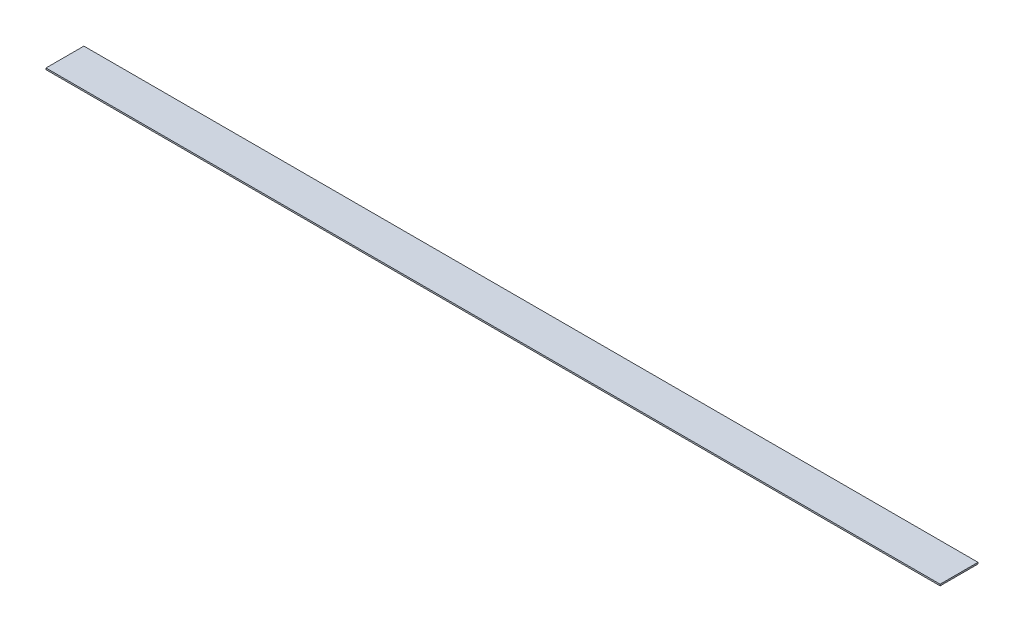
ISO-10303-21;
HEADER;
FILE_DESCRIPTION(('STEP AP214'),'2;1');
FILE_NAME('part.step','',(''),(''),'','','');
FILE_SCHEMA(('AUTOMOTIVE_DESIGN { 1 0 10303 214 1 1 1 1 }'));
ENDSEC;
DATA;
#1=APPLICATION_CONTEXT('core data for automotive mechanical design processes');
#2=APPLICATION_PROTOCOL_DEFINITION('international standard','automotive_design',2000,#1);
#3=PRODUCT_CONTEXT('',#1,'mechanical');
#4=PRODUCT('Part','Part','',(#3));
#5=PRODUCT_RELATED_PRODUCT_CATEGORY('part','',(#4));
#6=PRODUCT_DEFINITION_FORMATION('','',#4);
#7=PRODUCT_DEFINITION_CONTEXT('part definition',#1,'design');
#8=PRODUCT_DEFINITION('design','',#6,#7);
#9=PRODUCT_DEFINITION_SHAPE('','',#8);
#10=(LENGTH_UNIT() NAMED_UNIT(*) SI_UNIT(.MILLI.,.METRE.));
#11=(NAMED_UNIT(*) PLANE_ANGLE_UNIT() SI_UNIT($,.RADIAN.));
#12=(NAMED_UNIT(*) SI_UNIT($,.STERADIAN.) SOLID_ANGLE_UNIT());
#13=UNCERTAINTY_MEASURE_WITH_UNIT(LENGTH_MEASURE(1.E-05),#10,'distance_accuracy_value','');
#14=(GEOMETRIC_REPRESENTATION_CONTEXT(3) GLOBAL_UNCERTAINTY_ASSIGNED_CONTEXT((#13)) GLOBAL_UNIT_ASSIGNED_CONTEXT((#10,
#11,#12)) REPRESENTATION_CONTEXT('',''));
#15=CARTESIAN_POINT('',(0.,0.,0.));
#16=DIRECTION('',(0.,0.,1.));
#17=DIRECTION('',(1.,0.,0.));
#18=AXIS2_PLACEMENT_3D('',#15,#16,#17);
#19=CARTESIAN_POINT('',(295.,1.,-12.5));
#20=DIRECTION('',(-1.,0.,0.));
#21=DIRECTION('',(0.,0.,1.));
#22=AXIS2_PLACEMENT_3D('',#19,#20,#21);
#23=PLANE('',#22);
#24=DIRECTION('',(0.,0.,-1.));
#25=VECTOR('',#24,1.);
#26=CARTESIAN_POINT('',(295.,0.,-12.5));
#27=LINE('',#26,#25);
#28=CARTESIAN_POINT('',(295.,0.,12.5));
#29=VERTEX_POINT('',#28);
#30=CARTESIAN_POINT('',(295.,0.,-12.5));
#31=VERTEX_POINT('',#30);
#32=EDGE_CURVE('E98',#29,#31,#27,.T.);
#33=ORIENTED_EDGE('',*,*,#32,.T.);
#34=DIRECTION('',(0.,-1.,0.));
#35=VECTOR('',#34,1.);
#36=CARTESIAN_POINT('',(295.,1.,-12.5));
#37=LINE('',#36,#35);
#38=CARTESIAN_POINT('',(295.,1.,-12.5));
#39=VERTEX_POINT('',#38);
#40=EDGE_CURVE('E11',#39,#31,#37,.T.);
#41=ORIENTED_EDGE('',*,*,#40,.F.);
#42=DIRECTION('',(0.,0.,-1.));
#43=VECTOR('',#42,1.);
#44=CARTESIAN_POINT('',(295.,1.,-12.5));
#45=LINE('',#44,#43);
#46=CARTESIAN_POINT('',(295.,1.,12.5));
#47=VERTEX_POINT('',#46);
#48=EDGE_CURVE('E86',#47,#39,#45,.T.);
#49=ORIENTED_EDGE('',*,*,#48,.F.);
#50=DIRECTION('',(0.,-1.,0.));
#51=VECTOR('',#50,1.);
#52=CARTESIAN_POINT('',(295.,1.,12.5));
#53=LINE('',#52,#51);
#54=EDGE_CURVE('E94',#47,#29,#53,.T.);
#55=ORIENTED_EDGE('',*,*,#54,.T.);
#56=EDGE_LOOP('',(#33,#41,#49,#55));
#57=FACE_BOUND('',#56,.T.);
#58=ADVANCED_FACE('F35',(#57),#23,.F.);
#59=CARTESIAN_POINT('',(-295.,1.,-12.5));
#60=DIRECTION('',(0.,0.,1.));
#61=DIRECTION('',(1.,0.,0.));
#62=AXIS2_PLACEMENT_3D('',#59,#60,#61);
#63=PLANE('',#62);
#64=DIRECTION('',(-1.,0.,0.));
#65=VECTOR('',#64,1.);
#66=CARTESIAN_POINT('',(-295.,0.,-12.5));
#67=LINE('',#66,#65);
#68=CARTESIAN_POINT('',(-295.,0.,-12.5));
#69=VERTEX_POINT('',#68);
#70=EDGE_CURVE('E90',#31,#69,#67,.T.);
#71=ORIENTED_EDGE('',*,*,#70,.T.);
#72=DIRECTION('',(0.,-1.,0.));
#73=VECTOR('',#72,1.);
#74=CARTESIAN_POINT('',(-295.,1.,-12.5));
#75=LINE('',#74,#73);
#76=CARTESIAN_POINT('',(-295.,1.,-12.5));
#77=VERTEX_POINT('',#76);
#78=EDGE_CURVE('E43',#77,#69,#75,.T.);
#79=ORIENTED_EDGE('',*,*,#78,.F.);
#80=DIRECTION('',(-1.,0.,0.));
#81=VECTOR('',#80,1.);
#82=CARTESIAN_POINT('',(-295.,1.,-12.5));
#83=LINE('',#82,#81);
#84=EDGE_CURVE('E81',#39,#77,#83,.T.);
#85=ORIENTED_EDGE('',*,*,#84,.F.);
#86=ORIENTED_EDGE('',*,*,#40,.T.);
#87=EDGE_LOOP('',(#71,#79,#85,#86));
#88=FACE_BOUND('',#87,.T.);
#89=ADVANCED_FACE('F89',(#88),#63,.F.);
#90=CARTESIAN_POINT('',(-295.,1.,-12.5));
#91=DIRECTION('',(1.,0.,0.));
#92=DIRECTION('',(0.,0.,-1.));
#93=AXIS2_PLACEMENT_3D('',#90,#91,#92);
#94=PLANE('',#93);
#95=DIRECTION('',(0.,0.,1.));
#96=VECTOR('',#95,1.);
#97=CARTESIAN_POINT('',(-295.,0.,-12.5));
#98=LINE('',#97,#96);
#99=CARTESIAN_POINT('',(-295.,0.,12.5));
#100=VERTEX_POINT('',#99);
#101=EDGE_CURVE('E68',#69,#100,#98,.T.);
#102=ORIENTED_EDGE('',*,*,#101,.T.);
#103=DIRECTION('',(0.,-1.,0.));
#104=VECTOR('',#103,1.);
#105=CARTESIAN_POINT('',(-295.,1.,12.5));
#106=LINE('',#105,#104);
#107=CARTESIAN_POINT('',(-295.,1.,12.5));
#108=VERTEX_POINT('',#107);
#109=EDGE_CURVE('E91',#108,#100,#106,.T.);
#110=ORIENTED_EDGE('',*,*,#109,.F.);
#111=DIRECTION('',(0.,0.,1.));
#112=VECTOR('',#111,1.);
#113=CARTESIAN_POINT('',(-295.,1.,-12.5));
#114=LINE('',#113,#112);
#115=EDGE_CURVE('E84',#77,#108,#114,.T.);
#116=ORIENTED_EDGE('',*,*,#115,.F.);
#117=ORIENTED_EDGE('',*,*,#78,.T.);
#118=EDGE_LOOP('',(#102,#110,#116,#117));
#119=FACE_BOUND('',#118,.T.);
#120=ADVANCED_FACE('F92',(#119),#94,.F.);
#121=CARTESIAN_POINT('',(-295.,1.,12.5));
#122=DIRECTION('',(0.,0.,-1.));
#123=DIRECTION('',(-1.,0.,0.));
#124=AXIS2_PLACEMENT_3D('',#121,#122,#123);
#125=PLANE('',#124);
#126=DIRECTION('',(1.,0.,0.));
#127=VECTOR('',#126,1.);
#128=CARTESIAN_POINT('',(-295.,0.,12.5));
#129=LINE('',#128,#127);
#130=EDGE_CURVE('E74',#100,#29,#129,.T.);
#131=ORIENTED_EDGE('',*,*,#130,.T.);
#132=ORIENTED_EDGE('',*,*,#54,.F.);
#133=DIRECTION('',(1.,0.,0.));
#134=VECTOR('',#133,1.);
#135=CARTESIAN_POINT('',(-295.,1.,12.5));
#136=LINE('',#135,#134);
#137=EDGE_CURVE('E51',#108,#47,#136,.T.);
#138=ORIENTED_EDGE('',*,*,#137,.F.);
#139=ORIENTED_EDGE('',*,*,#109,.T.);
#140=EDGE_LOOP('',(#131,#132,#138,#139));
#141=FACE_BOUND('',#140,.T.);
#142=ADVANCED_FACE('F105',(#141),#125,.F.);
#143=CARTESIAN_POINT('',(0.,1.,0.));
#144=DIRECTION('',(0.,1.,0.));
#145=DIRECTION('',(0.,0.,1.));
#146=AXIS2_PLACEMENT_3D('',#143,#144,#145);
#147=PLANE('',#146);
#148=ORIENTED_EDGE('',*,*,#48,.T.);
#149=ORIENTED_EDGE('',*,*,#84,.T.);
#150=ORIENTED_EDGE('',*,*,#115,.T.);
#151=ORIENTED_EDGE('',*,*,#137,.T.);
#152=EDGE_LOOP('',(#148,#149,#150,#151));
#153=FACE_BOUND('',#152,.T.);
#154=ADVANCED_FACE('F82',(#153),#147,.T.);
#155=CARTESIAN_POINT('',(0.,0.,0.));
#156=DIRECTION('',(0.,1.,0.));
#157=DIRECTION('',(0.,0.,1.));
#158=AXIS2_PLACEMENT_3D('',#155,#156,#157);
#159=PLANE('',#158);
#160=ORIENTED_EDGE('',*,*,#32,.F.);
#161=ORIENTED_EDGE('',*,*,#130,.F.);
#162=ORIENTED_EDGE('',*,*,#101,.F.);
#163=ORIENTED_EDGE('',*,*,#70,.F.);
#164=EDGE_LOOP('',(#160,#161,#162,#163));
#165=FACE_BOUND('',#164,.T.);
#166=ADVANCED_FACE('F108',(#165),#159,.F.);
#167=CLOSED_SHELL('',(#58,#89,#120,#142,#154,#166));
#168=MANIFOLD_SOLID_BREP('B2',#167);
#169=ADVANCED_BREP_SHAPE_REPRESENTATION('',(#18,#168),#14);
#170=SHAPE_DEFINITION_REPRESENTATION(#9,#169);
ENDSEC;
END-ISO-10303-21;
